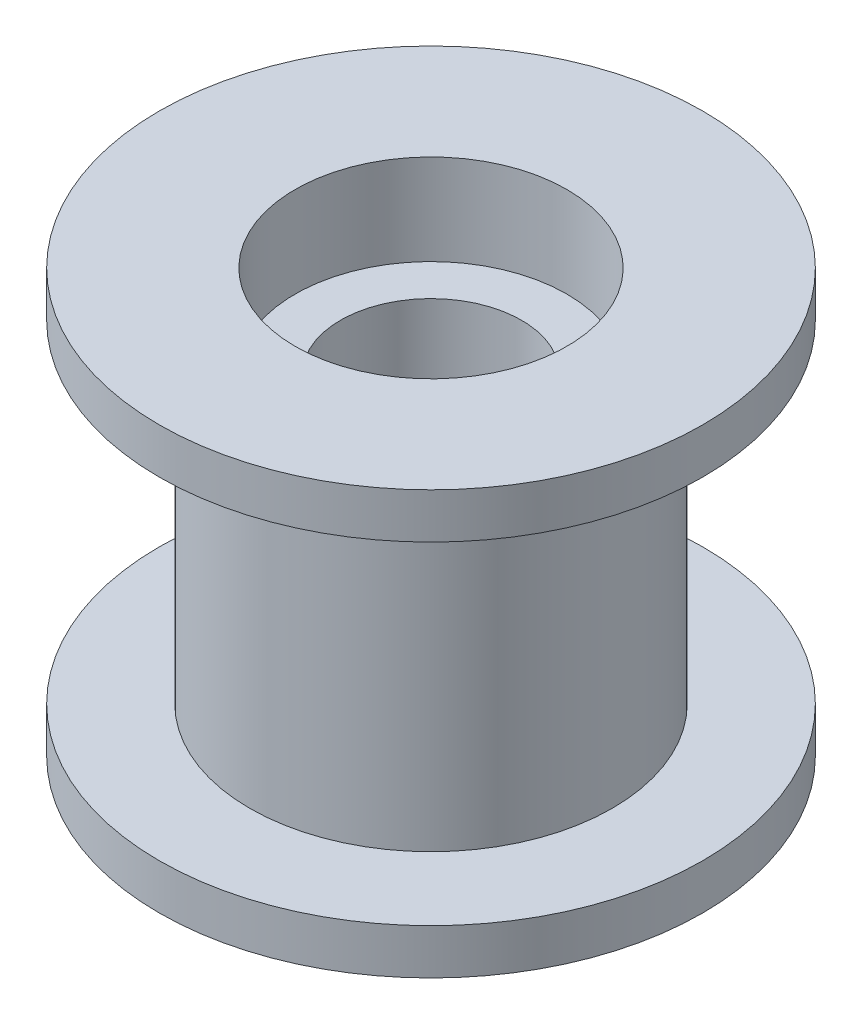
ISO-10303-21;
HEADER;
FILE_DESCRIPTION(('STEP AP214'),'2;1');
FILE_NAME('part.step','',(''),(''),'','','');
FILE_SCHEMA(('AUTOMOTIVE_DESIGN { 1 0 10303 214 1 1 1 1 }'));
ENDSEC;
DATA;
#1=APPLICATION_CONTEXT('core data for automotive mechanical design processes');
#2=APPLICATION_PROTOCOL_DEFINITION('international standard','automotive_design',2000,#1);
#3=PRODUCT_CONTEXT('',#1,'mechanical');
#4=PRODUCT('Part','Part','',(#3));
#5=PRODUCT_RELATED_PRODUCT_CATEGORY('part','',(#4));
#6=PRODUCT_DEFINITION_FORMATION('','',#4);
#7=PRODUCT_DEFINITION_CONTEXT('part definition',#1,'design');
#8=PRODUCT_DEFINITION('design','',#6,#7);
#9=PRODUCT_DEFINITION_SHAPE('','',#8);
#10=(LENGTH_UNIT() NAMED_UNIT(*) SI_UNIT(.MILLI.,.METRE.));
#11=(NAMED_UNIT(*) PLANE_ANGLE_UNIT() SI_UNIT($,.RADIAN.));
#12=(NAMED_UNIT(*) SI_UNIT($,.STERADIAN.) SOLID_ANGLE_UNIT());
#13=UNCERTAINTY_MEASURE_WITH_UNIT(LENGTH_MEASURE(1.E-05),#10,'distance_accuracy_value','');
#14=(GEOMETRIC_REPRESENTATION_CONTEXT(3) GLOBAL_UNCERTAINTY_ASSIGNED_CONTEXT((#13)) GLOBAL_UNIT_ASSIGNED_CONTEXT((#10,
#11,#12)) REPRESENTATION_CONTEXT('',''));
#15=CARTESIAN_POINT('',(0.,0.,0.));
#16=DIRECTION('',(0.,0.,1.));
#17=DIRECTION('',(1.,0.,0.));
#18=AXIS2_PLACEMENT_3D('',#15,#16,#17);
#19=CARTESIAN_POINT('',(0.,5.5,0.));
#20=DIRECTION('',(0.,-1.,0.));
#21=DIRECTION('',(0.,0.,-1.));
#22=AXIS2_PLACEMENT_3D('',#19,#20,#21);
#23=CYLINDRICAL_SURFACE('',#22,4.5);
#24=CARTESIAN_POINT('',(0.,-7.,0.));
#25=DIRECTION('',(0.,1.,0.));
#26=DIRECTION('',(0.,0.,1.));
#27=AXIS2_PLACEMENT_3D('',#24,#25,#26);
#28=CIRCLE('',#27,4.5);
#29=CARTESIAN_POINT('',(0.,-7.,4.5));
#30=VERTEX_POINT('',#29);
#31=EDGE_CURVE('E74',#30,#30,#28,.T.);
#32=ORIENTED_EDGE('',*,*,#31,.F.);
#33=EDGE_LOOP('',(#32));
#34=FACE_BOUND('',#33,.T.);
#35=CARTESIAN_POINT('',(0.,-4.,0.));
#36=DIRECTION('',(0.,1.,0.));
#37=DIRECTION('',(0.,0.,1.));
#38=AXIS2_PLACEMENT_3D('',#35,#36,#37);
#39=CIRCLE('',#38,4.5);
#40=CARTESIAN_POINT('',(0.,-4.,4.5));
#41=VERTEX_POINT('',#40);
#42=EDGE_CURVE('E80',#41,#41,#39,.T.);
#43=ORIENTED_EDGE('',*,*,#42,.T.);
#44=EDGE_LOOP('',(#43));
#45=FACE_BOUND('',#44,.T.);
#46=ADVANCED_FACE('F34',(#34,#45),#23,.F.);
#47=CARTESIAN_POINT('',(0.,5.5,0.));
#48=DIRECTION('',(0.,-1.,0.));
#49=DIRECTION('',(0.,0.,-1.));
#50=AXIS2_PLACEMENT_3D('',#47,#48,#49);
#51=CYLINDRICAL_SURFACE('',#50,6.);
#52=CARTESIAN_POINT('',(0.,5.5,0.));
#53=DIRECTION('',(0.,1.,0.));
#54=DIRECTION('',(0.,0.,1.));
#55=AXIS2_PLACEMENT_3D('',#52,#53,#54);
#56=CIRCLE('',#55,6.);
#57=CARTESIAN_POINT('',(0.,5.5,6.));
#58=VERTEX_POINT('',#57);
#59=EDGE_CURVE('E42',#58,#58,#56,.T.);
#60=ORIENTED_EDGE('',*,*,#59,.F.);
#61=EDGE_LOOP('',(#60));
#62=FACE_BOUND('',#61,.T.);
#63=CARTESIAN_POINT('',(0.,-5.5,0.));
#64=DIRECTION('',(0.,-1.,0.));
#65=DIRECTION('',(0.,0.,-1.));
#66=AXIS2_PLACEMENT_3D('',#63,#64,#65);
#67=CIRCLE('',#66,6.);
#68=CARTESIAN_POINT('',(0.,-5.5,-6.));
#69=VERTEX_POINT('',#68);
#70=EDGE_CURVE('E65',#69,#69,#67,.T.);
#71=ORIENTED_EDGE('',*,*,#70,.F.);
#72=EDGE_LOOP('',(#71));
#73=FACE_BOUND('',#72,.T.);
#74=ADVANCED_FACE('F36',(#62,#73),#51,.T.);
#75=CARTESIAN_POINT('',(0.,4.,0.));
#76=DIRECTION('',(0.,1.,0.));
#77=DIRECTION('',(0.,0.,1.));
#78=AXIS2_PLACEMENT_3D('',#75,#76,#77);
#79=CIRCLE('',#78,4.5);
#80=CARTESIAN_POINT('',(0.,4.,4.5));
#81=VERTEX_POINT('',#80);
#82=EDGE_CURVE('E10',#81,#81,#79,.T.);
#83=ORIENTED_EDGE('',*,*,#82,.F.);
#84=EDGE_LOOP('',(#83));
#85=FACE_BOUND('',#84,.T.);
#86=CARTESIAN_POINT('',(0.,7.,0.));
#87=DIRECTION('',(0.,1.,0.));
#88=DIRECTION('',(0.,0.,1.));
#89=AXIS2_PLACEMENT_3D('',#86,#87,#88);
#90=CIRCLE('',#89,4.5);
#91=CARTESIAN_POINT('',(0.,7.,4.5));
#92=VERTEX_POINT('',#91);
#93=EDGE_CURVE('E60',#92,#92,#90,.T.);
#94=ORIENTED_EDGE('',*,*,#93,.T.);
#95=EDGE_LOOP('',(#94));
#96=FACE_BOUND('',#95,.T.);
#97=ADVANCED_FACE('F111',(#85,#96),#23,.F.);
#98=CARTESIAN_POINT('',(0.,5.5,0.));
#99=DIRECTION('',(0.,1.,0.));
#100=DIRECTION('',(0.,0.,1.));
#101=AXIS2_PLACEMENT_3D('',#98,#99,#100);
#102=PLANE('',#101);
#103=CARTESIAN_POINT('',(0.,5.5,0.));
#104=DIRECTION('',(0.,1.,0.));
#105=DIRECTION('',(0.,0.,1.));
#106=AXIS2_PLACEMENT_3D('',#103,#104,#105);
#107=CIRCLE('',#106,9.);
#108=CARTESIAN_POINT('',(0.,5.5,9.));
#109=VERTEX_POINT('',#108);
#110=EDGE_CURVE('E55',#109,#109,#107,.T.);
#111=ORIENTED_EDGE('',*,*,#110,.F.);
#112=EDGE_LOOP('',(#111));
#113=FACE_BOUND('',#112,.T.);
#114=ORIENTED_EDGE('',*,*,#59,.T.);
#115=EDGE_LOOP('',(#114));
#116=FACE_BOUND('',#115,.T.);
#117=ADVANCED_FACE('F120',(#113,#116),#102,.F.);
#118=CARTESIAN_POINT('',(0.,7.,0.));
#119=DIRECTION('',(0.,1.,0.));
#120=DIRECTION('',(0.,0.,1.));
#121=AXIS2_PLACEMENT_3D('',#118,#119,#120);
#122=PLANE('',#121);
#123=CARTESIAN_POINT('',(0.,7.,0.));
#124=DIRECTION('',(0.,1.,0.));
#125=DIRECTION('',(0.,0.,1.));
#126=AXIS2_PLACEMENT_3D('',#123,#124,#125);
#127=CIRCLE('',#126,9.);
#128=CARTESIAN_POINT('',(0.,7.,9.));
#129=VERTEX_POINT('',#128);
#130=EDGE_CURVE('E49',#129,#129,#127,.T.);
#131=ORIENTED_EDGE('',*,*,#130,.T.);
#132=EDGE_LOOP('',(#131));
#133=FACE_BOUND('',#132,.T.);
#134=ORIENTED_EDGE('',*,*,#93,.F.);
#135=EDGE_LOOP('',(#134));
#136=FACE_BOUND('',#135,.T.);
#137=ADVANCED_FACE('F125',(#133,#136),#122,.T.);
#138=CARTESIAN_POINT('',(0.,7.,0.));
#139=DIRECTION('',(0.,-1.,0.));
#140=DIRECTION('',(0.,0.,-1.));
#141=AXIS2_PLACEMENT_3D('',#138,#139,#140);
#142=CYLINDRICAL_SURFACE('',#141,9.);
#143=ORIENTED_EDGE('',*,*,#130,.F.);
#144=EDGE_LOOP('',(#143));
#145=FACE_BOUND('',#144,.T.);
#146=ORIENTED_EDGE('',*,*,#110,.T.);
#147=EDGE_LOOP('',(#146));
#148=FACE_BOUND('',#147,.T.);
#149=ADVANCED_FACE('F132',(#145,#148),#142,.T.);
#150=CARTESIAN_POINT('',(0.,-5.5,0.));
#151=DIRECTION('',(0.,-1.,0.));
#152=DIRECTION('',(0.,0.,1.));
#153=AXIS2_PLACEMENT_3D('',#150,#151,#152);
#154=PLANE('',#153);
#155=CARTESIAN_POINT('',(0.,-5.5,0.));
#156=DIRECTION('',(0.,1.,0.));
#157=DIRECTION('',(0.,0.,1.));
#158=AXIS2_PLACEMENT_3D('',#155,#156,#157);
#159=CIRCLE('',#158,9.);
#160=CARTESIAN_POINT('',(0.,-5.5,9.));
#161=VERTEX_POINT('',#160);
#162=EDGE_CURVE('E70',#161,#161,#159,.T.);
#163=ORIENTED_EDGE('',*,*,#162,.T.);
#164=EDGE_LOOP('',(#163));
#165=FACE_BOUND('',#164,.T.);
#166=ORIENTED_EDGE('',*,*,#70,.T.);
#167=EDGE_LOOP('',(#166));
#168=FACE_BOUND('',#167,.T.);
#169=ADVANCED_FACE('F138',(#165,#168),#154,.F.);
#170=CARTESIAN_POINT('',(0.,-7.,0.));
#171=DIRECTION('',(0.,1.,0.));
#172=DIRECTION('',(0.,0.,1.));
#173=AXIS2_PLACEMENT_3D('',#170,#171,#172);
#174=CYLINDRICAL_SURFACE('',#173,9.);
#175=CARTESIAN_POINT('',(0.,-7.,0.));
#176=DIRECTION('',(0.,1.,0.));
#177=DIRECTION('',(0.,0.,1.));
#178=AXIS2_PLACEMENT_3D('',#175,#176,#177);
#179=CIRCLE('',#178,9.);
#180=CARTESIAN_POINT('',(0.,-7.,9.));
#181=VERTEX_POINT('',#180);
#182=EDGE_CURVE('E69',#181,#181,#179,.T.);
#183=ORIENTED_EDGE('',*,*,#182,.T.);
#184=EDGE_LOOP('',(#183));
#185=FACE_BOUND('',#184,.T.);
#186=ORIENTED_EDGE('',*,*,#162,.F.);
#187=EDGE_LOOP('',(#186));
#188=FACE_BOUND('',#187,.T.);
#189=ADVANCED_FACE('F105',(#185,#188),#174,.T.);
#190=CARTESIAN_POINT('',(0.,-7.,0.));
#191=DIRECTION('',(0.,-1.,0.));
#192=DIRECTION('',(0.,0.,1.));
#193=AXIS2_PLACEMENT_3D('',#190,#191,#192);
#194=PLANE('',#193);
#195=ORIENTED_EDGE('',*,*,#31,.T.);
#196=EDGE_LOOP('',(#195));
#197=FACE_BOUND('',#196,.T.);
#198=ORIENTED_EDGE('',*,*,#182,.F.);
#199=EDGE_LOOP('',(#198));
#200=FACE_BOUND('',#199,.T.);
#201=ADVANCED_FACE('F97',(#197,#200),#194,.T.);
#202=CARTESIAN_POINT('',(0.,4.,0.));
#203=DIRECTION('',(0.,1.,0.));
#204=DIRECTION('',(0.,0.,1.));
#205=AXIS2_PLACEMENT_3D('',#202,#203,#204);
#206=PLANE('',#205);
#207=ORIENTED_EDGE('',*,*,#82,.T.);
#208=EDGE_LOOP('',(#207));
#209=FACE_BOUND('',#208,.T.);
#210=CARTESIAN_POINT('',(0.,4.,0.));
#211=DIRECTION('',(0.,1.,0.));
#212=DIRECTION('',(0.,0.,1.));
#213=AXIS2_PLACEMENT_3D('',#210,#211,#212);
#214=CIRCLE('',#213,3.);
#215=CARTESIAN_POINT('',(0.,4.,3.));
#216=VERTEX_POINT('',#215);
#217=EDGE_CURVE('E84',#216,#216,#214,.T.);
#218=ORIENTED_EDGE('',*,*,#217,.F.);
#219=EDGE_LOOP('',(#218));
#220=FACE_BOUND('',#219,.T.);
#221=ADVANCED_FACE('F94',(#209,#220),#206,.T.);
#222=CARTESIAN_POINT('',(0.,-4.,0.));
#223=DIRECTION('',(0.,1.,0.));
#224=DIRECTION('',(0.,0.,1.));
#225=AXIS2_PLACEMENT_3D('',#222,#223,#224);
#226=PLANE('',#225);
#227=ORIENTED_EDGE('',*,*,#42,.F.);
#228=EDGE_LOOP('',(#227));
#229=FACE_BOUND('',#228,.T.);
#230=CARTESIAN_POINT('',(0.,-4.,0.));
#231=DIRECTION('',(0.,1.,0.));
#232=DIRECTION('',(0.,0.,1.));
#233=AXIS2_PLACEMENT_3D('',#230,#231,#232);
#234=CIRCLE('',#233,3.);
#235=CARTESIAN_POINT('',(0.,-4.,3.));
#236=VERTEX_POINT('',#235);
#237=EDGE_CURVE('E85',#236,#236,#234,.T.);
#238=ORIENTED_EDGE('',*,*,#237,.T.);
#239=EDGE_LOOP('',(#238));
#240=FACE_BOUND('',#239,.T.);
#241=ADVANCED_FACE('F96',(#229,#240),#226,.F.);
#242=CARTESIAN_POINT('',(0.,4.,0.));
#243=DIRECTION('',(0.,-1.,0.));
#244=DIRECTION('',(0.,0.,-1.));
#245=AXIS2_PLACEMENT_3D('',#242,#243,#244);
#246=CYLINDRICAL_SURFACE('',#245,3.);
#247=ORIENTED_EDGE('',*,*,#217,.T.);
#248=EDGE_LOOP('',(#247));
#249=FACE_BOUND('',#248,.T.);
#250=ORIENTED_EDGE('',*,*,#237,.F.);
#251=EDGE_LOOP('',(#250));
#252=FACE_BOUND('',#251,.T.);
#253=ADVANCED_FACE('F91',(#249,#252),#246,.F.);
#254=CLOSED_SHELL('',(#46,#74,#97,#117,#137,#149,#169,#189,#201,#221,#241,#253));
#255=MANIFOLD_SOLID_BREP('B2',#254);
#256=ADVANCED_BREP_SHAPE_REPRESENTATION('',(#18,#255),#14);
#257=SHAPE_DEFINITION_REPRESENTATION(#9,#256);
ENDSEC;
END-ISO-10303-21;
